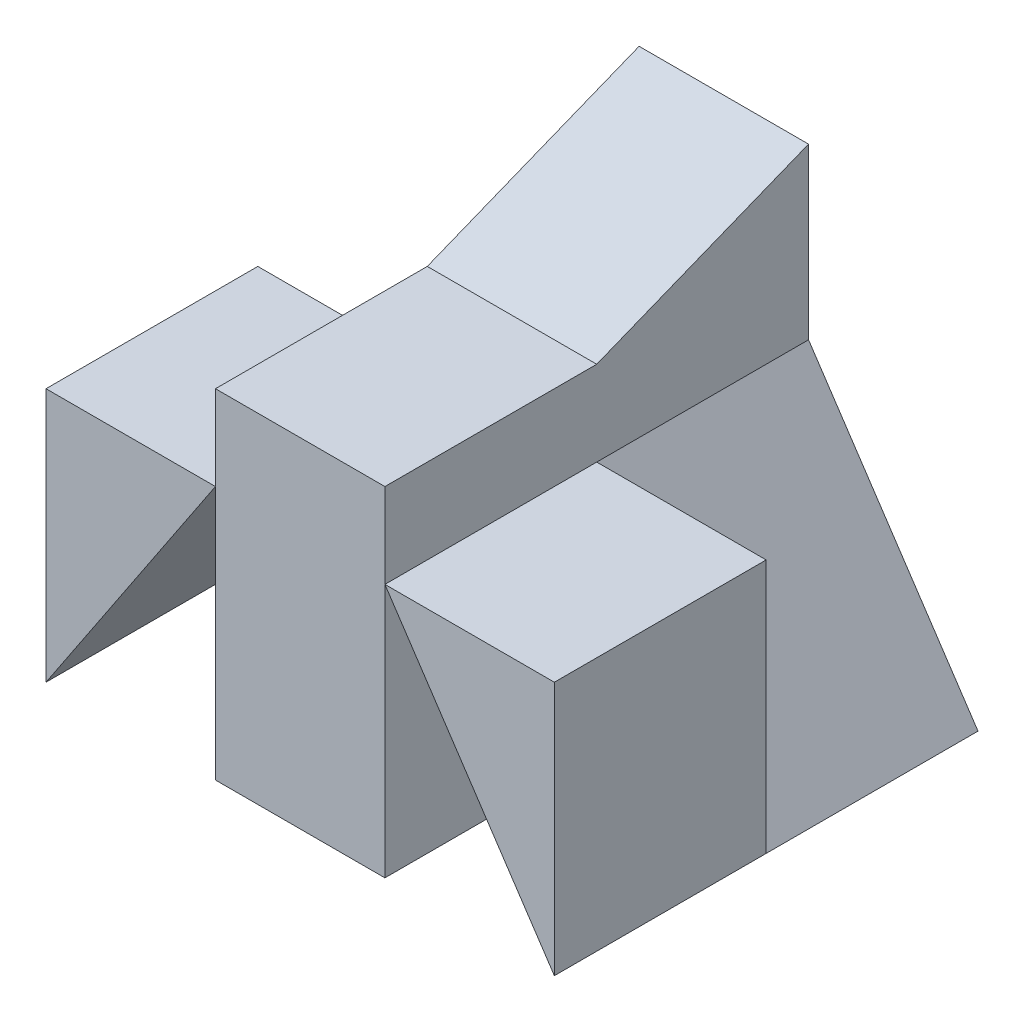
ISO-10303-21;
HEADER;
FILE_DESCRIPTION(('STEP AP214'),'2;1');
FILE_NAME('part.step','',(''),(''),'','','');
FILE_SCHEMA(('AUTOMOTIVE_DESIGN { 1 0 10303 214 1 1 1 1 }'));
ENDSEC;
DATA;
#1=APPLICATION_CONTEXT('core data for automotive mechanical design processes');
#2=APPLICATION_PROTOCOL_DEFINITION('international standard','automotive_design',2000,#1);
#3=PRODUCT_CONTEXT('',#1,'mechanical');
#4=PRODUCT('Part','Part','',(#3));
#5=PRODUCT_RELATED_PRODUCT_CATEGORY('part','',(#4));
#6=PRODUCT_DEFINITION_FORMATION('','',#4);
#7=PRODUCT_DEFINITION_CONTEXT('part definition',#1,'design');
#8=PRODUCT_DEFINITION('design','',#6,#7);
#9=PRODUCT_DEFINITION_SHAPE('','',#8);
#10=(LENGTH_UNIT() NAMED_UNIT(*) SI_UNIT(.MILLI.,.METRE.));
#11=(NAMED_UNIT(*) PLANE_ANGLE_UNIT() SI_UNIT($,.RADIAN.));
#12=(NAMED_UNIT(*) SI_UNIT($,.STERADIAN.) SOLID_ANGLE_UNIT());
#13=UNCERTAINTY_MEASURE_WITH_UNIT(LENGTH_MEASURE(1.E-05),#10,'distance_accuracy_value','');
#14=(GEOMETRIC_REPRESENTATION_CONTEXT(3) GLOBAL_UNCERTAINTY_ASSIGNED_CONTEXT((#13)) GLOBAL_UNIT_ASSIGNED_CONTEXT((#10,
#11,#12)) REPRESENTATION_CONTEXT('',''));
#15=CARTESIAN_POINT('',(0.,0.,0.));
#16=DIRECTION('',(0.,0.,1.));
#17=DIRECTION('',(1.,0.,0.));
#18=AXIS2_PLACEMENT_3D('',#15,#16,#17);
#19=CARTESIAN_POINT('',(0.,0.,5.));
#20=DIRECTION('',(0.,0.,1.));
#21=DIRECTION('',(1.,0.,0.));
#22=AXIS2_PLACEMENT_3D('',#19,#20,#21);
#23=PLANE('',#22);
#24=DIRECTION('',(0.,1.,0.));
#25=VECTOR('',#24,1.);
#26=CARTESIAN_POINT('',(2.,0.,5.));
#27=LINE('',#26,#25);
#28=CARTESIAN_POINT('',(2.,0.,5.));
#29=VERTEX_POINT('',#28);
#30=CARTESIAN_POINT('',(2.,4.,5.));
#31=VERTEX_POINT('',#30);
#32=EDGE_CURVE('E111',#29,#31,#27,.T.);
#33=ORIENTED_EDGE('',*,*,#32,.F.);
#34=DIRECTION('',(1.,0.,0.));
#35=VECTOR('',#34,1.);
#36=CARTESIAN_POINT('',(0.,0.,5.));
#37=LINE('',#36,#35);
#38=CARTESIAN_POINT('',(4.,0.,5.));
#39=VERTEX_POINT('',#38);
#40=EDGE_CURVE('E130',#29,#39,#37,.T.);
#41=ORIENTED_EDGE('',*,*,#40,.T.);
#42=DIRECTION('',(0.,1.,0.));
#43=VECTOR('',#42,1.);
#44=CARTESIAN_POINT('',(4.,0.,5.));
#45=LINE('',#44,#43);
#46=CARTESIAN_POINT('',(4.,4.,5.));
#47=VERTEX_POINT('',#46);
#48=EDGE_CURVE('E139',#39,#47,#45,.T.);
#49=ORIENTED_EDGE('',*,*,#48,.T.);
#50=DIRECTION('',(1.,0.,0.));
#51=VECTOR('',#50,1.);
#52=CARTESIAN_POINT('',(0.,4.,5.));
#53=LINE('',#52,#51);
#54=EDGE_CURVE('E141',#31,#47,#53,.T.);
#55=ORIENTED_EDGE('',*,*,#54,.F.);
#56=EDGE_LOOP('',(#33,#41,#49,#55));
#57=FACE_BOUND('',#56,.T.);
#58=ADVANCED_FACE('F46',(#57),#23,.T.);
#59=CARTESIAN_POINT('',(0.,0.,5.));
#60=DIRECTION('',(0.,1.,0.));
#61=DIRECTION('',(0.,0.,1.));
#62=AXIS2_PLACEMENT_3D('',#59,#60,#61);
#63=PLANE('',#62);
#64=ORIENTED_EDGE('',*,*,#40,.F.);
#65=DIRECTION('',(0.,0.,1.));
#66=VECTOR('',#65,1.);
#67=CARTESIAN_POINT('',(2.,0.,2.5));
#68=LINE('',#67,#66);
#69=CARTESIAN_POINT('',(2.,0.,2.5));
#70=VERTEX_POINT('',#69);
#71=EDGE_CURVE('E120',#70,#29,#68,.T.);
#72=ORIENTED_EDGE('',*,*,#71,.F.);
#73=DIRECTION('',(1.,0.,0.));
#74=VECTOR('',#73,1.);
#75=CARTESIAN_POINT('',(0.,0.,2.5));
#76=LINE('',#75,#74);
#77=CARTESIAN_POINT('',(0.,0.,2.5));
#78=VERTEX_POINT('',#77);
#79=EDGE_CURVE('E12',#78,#70,#76,.T.);
#80=ORIENTED_EDGE('',*,*,#79,.F.);
#81=DIRECTION('',(0.,0.,-1.));
#82=VECTOR('',#81,1.);
#83=CARTESIAN_POINT('',(0.,0.,2.5));
#84=LINE('',#83,#82);
#85=CARTESIAN_POINT('',(0.,0.,0.));
#86=VERTEX_POINT('',#85);
#87=EDGE_CURVE('E137',#78,#86,#84,.T.);
#88=ORIENTED_EDGE('',*,*,#87,.T.);
#89=DIRECTION('',(1.,0.,0.));
#90=VECTOR('',#89,1.);
#91=CARTESIAN_POINT('',(0.,0.,0.));
#92=LINE('',#91,#90);
#93=CARTESIAN_POINT('',(6.,0.,0.));
#94=VERTEX_POINT('',#93);
#95=EDGE_CURVE('E138',#86,#94,#92,.T.);
#96=ORIENTED_EDGE('',*,*,#95,.T.);
#97=DIRECTION('',(0.,0.,-1.));
#98=VECTOR('',#97,1.);
#99=CARTESIAN_POINT('',(6.,0.,2.5));
#100=LINE('',#99,#98);
#101=CARTESIAN_POINT('',(6.,0.,2.5));
#102=VERTEX_POINT('',#101);
#103=EDGE_CURVE('E172',#102,#94,#100,.T.);
#104=ORIENTED_EDGE('',*,*,#103,.F.);
#105=DIRECTION('',(1.,0.,0.));
#106=VECTOR('',#105,1.);
#107=CARTESIAN_POINT('',(6.,0.,2.5));
#108=LINE('',#107,#106);
#109=CARTESIAN_POINT('',(4.,0.,2.5));
#110=VERTEX_POINT('',#109);
#111=EDGE_CURVE('E179',#110,#102,#108,.T.);
#112=ORIENTED_EDGE('',*,*,#111,.F.);
#113=DIRECTION('',(0.,0.,1.));
#114=VECTOR('',#113,1.);
#115=CARTESIAN_POINT('',(4.,0.,2.5));
#116=LINE('',#115,#114);
#117=EDGE_CURVE('E156',#110,#39,#116,.T.);
#118=ORIENTED_EDGE('',*,*,#117,.T.);
#119=EDGE_LOOP('',(#64,#72,#80,#88,#96,#104,#112,#118));
#120=FACE_BOUND('',#119,.T.);
#121=ADVANCED_FACE('F128',(#120),#63,.F.);
#122=CARTESIAN_POINT('',(4.,0.,5.));
#123=DIRECTION('',(-1.,0.,0.));
#124=DIRECTION('',(0.,0.,1.));
#125=AXIS2_PLACEMENT_3D('',#122,#123,#124);
#126=PLANE('',#125);
#127=DIRECTION('',(0.,1.,0.));
#128=VECTOR('',#127,1.);
#129=CARTESIAN_POINT('',(4.,0.,0.));
#130=LINE('',#129,#128);
#131=CARTESIAN_POINT('',(4.,3.,0.));
#132=VERTEX_POINT('',#131);
#133=CARTESIAN_POINT('',(4.,5.,0.));
#134=VERTEX_POINT('',#133);
#135=EDGE_CURVE('E152',#132,#134,#130,.T.);
#136=ORIENTED_EDGE('',*,*,#135,.T.);
#137=DIRECTION('',(0.,0.371390676354103,-0.928476690885259));
#138=VECTOR('',#137,1.);
#139=CARTESIAN_POINT('',(4.,5.,0.));
#140=LINE('',#139,#138);
#141=CARTESIAN_POINT('',(4.,4.,2.5));
#142=VERTEX_POINT('',#141);
#143=EDGE_CURVE('E164',#142,#134,#140,.T.);
#144=ORIENTED_EDGE('',*,*,#143,.F.);
#145=DIRECTION('',(0.,0.,-1.));
#146=VECTOR('',#145,1.);
#147=CARTESIAN_POINT('',(4.,4.,2.5));
#148=LINE('',#147,#146);
#149=EDGE_CURVE('E143',#47,#142,#148,.T.);
#150=ORIENTED_EDGE('',*,*,#149,.F.);
#151=ORIENTED_EDGE('',*,*,#48,.F.);
#152=ORIENTED_EDGE('',*,*,#117,.F.);
#153=DIRECTION('',(0.,-1.,0.));
#154=VECTOR('',#153,1.);
#155=CARTESIAN_POINT('',(4.,0.,2.5));
#156=LINE('',#155,#154);
#157=CARTESIAN_POINT('',(4.,3.,2.5));
#158=VERTEX_POINT('',#157);
#159=EDGE_CURVE('E174',#158,#110,#156,.T.);
#160=ORIENTED_EDGE('',*,*,#159,.F.);
#161=DIRECTION('',(0.,0.,-1.));
#162=VECTOR('',#161,1.);
#163=CARTESIAN_POINT('',(4.,3.,2.5));
#164=LINE('',#163,#162);
#165=EDGE_CURVE('E155',#158,#132,#164,.T.);
#166=ORIENTED_EDGE('',*,*,#165,.T.);
#167=EDGE_LOOP('',(#136,#144,#150,#151,#152,#160,#166));
#168=FACE_BOUND('',#167,.T.);
#169=ADVANCED_FACE('F192',(#168),#126,.F.);
#170=CARTESIAN_POINT('',(2.,0.,5.));
#171=DIRECTION('',(-1.,0.,0.));
#172=DIRECTION('',(0.,0.,1.));
#173=AXIS2_PLACEMENT_3D('',#170,#171,#172);
#174=PLANE('',#173);
#175=DIRECTION('',(0.,-0.371390676354103,0.928476690885259));
#176=VECTOR('',#175,1.);
#177=CARTESIAN_POINT('',(2.,2.58620689655173,6.03448275862069));
#178=LINE('',#177,#176);
#179=CARTESIAN_POINT('',(2.,5.,0.));
#180=VERTEX_POINT('',#179);
#181=CARTESIAN_POINT('',(2.,4.,2.5));
#182=VERTEX_POINT('',#181);
#183=EDGE_CURVE('E151',#180,#182,#178,.T.);
#184=ORIENTED_EDGE('',*,*,#183,.F.);
#185=DIRECTION('',(0.,1.,0.));
#186=VECTOR('',#185,1.);
#187=CARTESIAN_POINT('',(2.,0.,0.));
#188=LINE('',#187,#186);
#189=CARTESIAN_POINT('',(2.,3.,0.));
#190=VERTEX_POINT('',#189);
#191=EDGE_CURVE('E145',#190,#180,#188,.T.);
#192=ORIENTED_EDGE('',*,*,#191,.F.);
#193=DIRECTION('',(0.,0.,-1.));
#194=VECTOR('',#193,1.);
#195=CARTESIAN_POINT('',(2.,3.,2.5));
#196=LINE('',#195,#194);
#197=CARTESIAN_POINT('',(2.,3.,2.5));
#198=VERTEX_POINT('',#197);
#199=EDGE_CURVE('E123',#198,#190,#196,.T.);
#200=ORIENTED_EDGE('',*,*,#199,.F.);
#201=DIRECTION('',(0.,1.,0.));
#202=VECTOR('',#201,1.);
#203=CARTESIAN_POINT('',(2.,0.,2.5));
#204=LINE('',#203,#202);
#205=EDGE_CURVE('E116',#70,#198,#204,.T.);
#206=ORIENTED_EDGE('',*,*,#205,.F.);
#207=ORIENTED_EDGE('',*,*,#71,.T.);
#208=ORIENTED_EDGE('',*,*,#32,.T.);
#209=DIRECTION('',(0.,0.,1.));
#210=VECTOR('',#209,1.);
#211=CARTESIAN_POINT('',(2.,4.,5.));
#212=LINE('',#211,#210);
#213=EDGE_CURVE('E144',#182,#31,#212,.T.);
#214=ORIENTED_EDGE('',*,*,#213,.F.);
#215=EDGE_LOOP('',(#184,#192,#200,#206,#207,#208,#214));
#216=FACE_BOUND('',#215,.T.);
#217=ADVANCED_FACE('F118',(#216),#174,.T.);
#218=CARTESIAN_POINT('',(0.,0.,0.));
#219=DIRECTION('',(0.,0.,1.));
#220=DIRECTION('',(1.,0.,0.));
#221=AXIS2_PLACEMENT_3D('',#218,#219,#220);
#222=PLANE('',#221);
#223=ORIENTED_EDGE('',*,*,#95,.F.);
#224=DIRECTION('',(-0.554700196225229,-0.832050294337844,0.));
#225=VECTOR('',#224,1.);
#226=CARTESIAN_POINT('',(2.,3.,0.));
#227=LINE('',#226,#225);
#228=EDGE_CURVE('E132',#190,#86,#227,.T.);
#229=ORIENTED_EDGE('',*,*,#228,.F.);
#230=ORIENTED_EDGE('',*,*,#191,.T.);
#231=DIRECTION('',(1.,0.,0.));
#232=VECTOR('',#231,1.);
#233=CARTESIAN_POINT('',(0.,5.,0.));
#234=LINE('',#233,#232);
#235=EDGE_CURVE('E148',#180,#134,#234,.T.);
#236=ORIENTED_EDGE('',*,*,#235,.T.);
#237=ORIENTED_EDGE('',*,*,#135,.F.);
#238=DIRECTION('',(-0.554700196225229,0.832050294337844,0.));
#239=VECTOR('',#238,1.);
#240=CARTESIAN_POINT('',(4.,3.,0.));
#241=LINE('',#240,#239);
#242=EDGE_CURVE('E171',#94,#132,#241,.T.);
#243=ORIENTED_EDGE('',*,*,#242,.F.);
#244=EDGE_LOOP('',(#223,#229,#230,#236,#237,#243));
#245=FACE_BOUND('',#244,.T.);
#246=ADVANCED_FACE('F199',(#245),#222,.F.);
#247=CARTESIAN_POINT('',(-1.,5.,0.));
#248=DIRECTION('',(0.,-0.928476690885259,-0.371390676354103));
#249=DIRECTION('',(0.,0.371390676354103,-0.928476690885259));
#250=AXIS2_PLACEMENT_3D('',#247,#248,#249);
#251=PLANE('',#250);
#252=ORIENTED_EDGE('',*,*,#183,.T.);
#253=DIRECTION('',(1.,0.,0.));
#254=VECTOR('',#253,1.);
#255=CARTESIAN_POINT('',(-1.,4.,2.5));
#256=LINE('',#255,#254);
#257=EDGE_CURVE('E166',#182,#142,#256,.T.);
#258=ORIENTED_EDGE('',*,*,#257,.T.);
#259=ORIENTED_EDGE('',*,*,#143,.T.);
#260=ORIENTED_EDGE('',*,*,#235,.F.);
#261=EDGE_LOOP('',(#252,#258,#259,#260));
#262=FACE_BOUND('',#261,.T.);
#263=ADVANCED_FACE('F206',(#262),#251,.F.);
#264=CARTESIAN_POINT('',(-1.,4.,2.5));
#265=DIRECTION('',(0.,-1.,0.));
#266=DIRECTION('',(0.,0.,-1.));
#267=AXIS2_PLACEMENT_3D('',#264,#265,#266);
#268=PLANE('',#267);
#269=ORIENTED_EDGE('',*,*,#213,.T.);
#270=ORIENTED_EDGE('',*,*,#54,.T.);
#271=ORIENTED_EDGE('',*,*,#149,.T.);
#272=ORIENTED_EDGE('',*,*,#257,.F.);
#273=EDGE_LOOP('',(#269,#270,#271,#272));
#274=FACE_BOUND('',#273,.T.);
#275=ADVANCED_FACE('F208',(#274),#268,.F.);
#276=CARTESIAN_POINT('',(4.,3.,2.5));
#277=DIRECTION('',(-0.832050294337844,-0.554700196225229,0.));
#278=DIRECTION('',(0.554700196225229,-0.832050294337844,0.));
#279=AXIS2_PLACEMENT_3D('',#276,#277,#278);
#280=PLANE('',#279);
#281=ORIENTED_EDGE('',*,*,#242,.T.);
#282=ORIENTED_EDGE('',*,*,#165,.F.);
#283=DIRECTION('',(-0.554700196225229,0.832050294337844,0.));
#284=VECTOR('',#283,1.);
#285=CARTESIAN_POINT('',(4.,3.,2.5));
#286=LINE('',#285,#284);
#287=EDGE_CURVE('E136',#102,#158,#286,.T.);
#288=ORIENTED_EDGE('',*,*,#287,.F.);
#289=ORIENTED_EDGE('',*,*,#103,.T.);
#290=EDGE_LOOP('',(#281,#282,#288,#289));
#291=FACE_BOUND('',#290,.T.);
#292=ADVANCED_FACE('F195',(#291),#280,.F.);
#293=CARTESIAN_POINT('',(0.,0.,2.5));
#294=DIRECTION('',(0.,0.,1.));
#295=DIRECTION('',(1.,0.,0.));
#296=AXIS2_PLACEMENT_3D('',#293,#294,#295);
#297=PLANE('',#296);
#298=ORIENTED_EDGE('',*,*,#159,.T.);
#299=ORIENTED_EDGE('',*,*,#111,.T.);
#300=ORIENTED_EDGE('',*,*,#287,.T.);
#301=EDGE_LOOP('',(#298,#299,#300));
#302=FACE_BOUND('',#301,.T.);
#303=ADVANCED_FACE('F186',(#302),#297,.T.);
#304=CARTESIAN_POINT('',(2.,3.,2.5));
#305=DIRECTION('',(0.832050294337844,-0.554700196225229,0.));
#306=DIRECTION('',(0.554700196225229,0.832050294337844,0.));
#307=AXIS2_PLACEMENT_3D('',#304,#305,#306);
#308=PLANE('',#307);
#309=ORIENTED_EDGE('',*,*,#228,.T.);
#310=ORIENTED_EDGE('',*,*,#87,.F.);
#311=DIRECTION('',(-0.554700196225229,-0.832050294337844,0.));
#312=VECTOR('',#311,1.);
#313=CARTESIAN_POINT('',(2.,3.,2.5));
#314=LINE('',#313,#312);
#315=EDGE_CURVE('E49',#198,#78,#314,.T.);
#316=ORIENTED_EDGE('',*,*,#315,.F.);
#317=ORIENTED_EDGE('',*,*,#199,.T.);
#318=EDGE_LOOP('',(#309,#310,#316,#317));
#319=FACE_BOUND('',#318,.T.);
#320=ADVANCED_FACE('F202',(#319),#308,.F.);
#321=CARTESIAN_POINT('',(0.,0.,2.5));
#322=DIRECTION('',(0.,0.,-1.));
#323=DIRECTION('',(-1.,0.,0.));
#324=AXIS2_PLACEMENT_3D('',#321,#322,#323);
#325=PLANE('',#324);
#326=ORIENTED_EDGE('',*,*,#205,.T.);
#327=ORIENTED_EDGE('',*,*,#315,.T.);
#328=ORIENTED_EDGE('',*,*,#79,.T.);
#329=EDGE_LOOP('',(#326,#327,#328));
#330=FACE_BOUND('',#329,.T.);
#331=ADVANCED_FACE('F125',(#330),#325,.F.);
#332=CLOSED_SHELL('',(#58,#121,#169,#217,#246,#263,#275,#292,#303,#320,#331));
#333=MANIFOLD_SOLID_BREP('B2',#332);
#334=CARTESIAN_POINT('',(0.,0.,2.5));
#335=DIRECTION('',(0.,0.,-1.));
#336=DIRECTION('',(-1.,0.,0.));
#337=AXIS2_PLACEMENT_3D('',#334,#335,#336);
#338=PLANE('',#337);
#339=DIRECTION('',(0.,1.,0.));
#340=VECTOR('',#339,1.);
#341=CARTESIAN_POINT('',(0.,0.,2.5));
#342=LINE('',#341,#340);
#343=CARTESIAN_POINT('',(0.,0.,2.5));
#344=VERTEX_POINT('',#343);
#345=CARTESIAN_POINT('',(0.,3.,2.5));
#346=VERTEX_POINT('',#345);
#347=EDGE_CURVE('E363',#344,#346,#342,.T.);
#348=ORIENTED_EDGE('',*,*,#347,.T.);
#349=DIRECTION('',(1.,0.,0.));
#350=VECTOR('',#349,1.);
#351=CARTESIAN_POINT('',(0.,3.,2.5));
#352=LINE('',#351,#350);
#353=CARTESIAN_POINT('',(2.,3.,2.5));
#354=VERTEX_POINT('',#353);
#355=EDGE_CURVE('E361',#346,#354,#352,.T.);
#356=ORIENTED_EDGE('',*,*,#355,.T.);
#357=DIRECTION('',(-0.554700196225229,-0.832050294337844,0.));
#358=VECTOR('',#357,1.);
#359=CARTESIAN_POINT('',(2.,3.,2.5));
#360=LINE('',#359,#358);
#361=EDGE_CURVE('E354',#354,#344,#360,.T.);
#362=ORIENTED_EDGE('',*,*,#361,.T.);
#363=EDGE_LOOP('',(#348,#356,#362));
#364=FACE_BOUND('',#363,.T.);
#365=ADVANCED_FACE('F321',(#364),#338,.T.);
#366=CARTESIAN_POINT('',(0.,3.,5.));
#367=DIRECTION('',(0.,1.,0.));
#368=DIRECTION('',(0.,0.,1.));
#369=AXIS2_PLACEMENT_3D('',#366,#367,#368);
#370=PLANE('',#369);
#371=DIRECTION('',(0.,0.,-1.));
#372=VECTOR('',#371,1.);
#373=CARTESIAN_POINT('',(2.,3.,5.));
#374=LINE('',#373,#372);
#375=CARTESIAN_POINT('',(2.,3.,5.));
#376=VERTEX_POINT('',#375);
#377=EDGE_CURVE('E44',#376,#354,#374,.T.);
#378=ORIENTED_EDGE('',*,*,#377,.T.);
#379=ORIENTED_EDGE('',*,*,#355,.F.);
#380=DIRECTION('',(0.,0.,-1.));
#381=VECTOR('',#380,1.);
#382=CARTESIAN_POINT('',(0.,3.,5.));
#383=LINE('',#382,#381);
#384=CARTESIAN_POINT('',(0.,3.,5.));
#385=VERTEX_POINT('',#384);
#386=EDGE_CURVE('E330',#385,#346,#383,.T.);
#387=ORIENTED_EDGE('',*,*,#386,.F.);
#388=DIRECTION('',(1.,0.,0.));
#389=VECTOR('',#388,1.);
#390=CARTESIAN_POINT('',(0.,3.,5.));
#391=LINE('',#390,#389);
#392=EDGE_CURVE('E325',#385,#376,#391,.T.);
#393=ORIENTED_EDGE('',*,*,#392,.T.);
#394=EDGE_LOOP('',(#378,#379,#387,#393));
#395=FACE_BOUND('',#394,.T.);
#396=ADVANCED_FACE('F323',(#395),#370,.T.);
#397=CARTESIAN_POINT('',(0.,0.,5.));
#398=DIRECTION('',(-1.,0.,0.));
#399=DIRECTION('',(0.,0.,1.));
#400=AXIS2_PLACEMENT_3D('',#397,#398,#399);
#401=PLANE('',#400);
#402=ORIENTED_EDGE('',*,*,#386,.T.);
#403=ORIENTED_EDGE('',*,*,#347,.F.);
#404=DIRECTION('',(0.,0.,-1.));
#405=VECTOR('',#404,1.);
#406=CARTESIAN_POINT('',(0.,0.,5.));
#407=LINE('',#406,#405);
#408=CARTESIAN_POINT('',(0.,0.,5.));
#409=VERTEX_POINT('',#408);
#410=EDGE_CURVE('E358',#409,#344,#407,.T.);
#411=ORIENTED_EDGE('',*,*,#410,.F.);
#412=DIRECTION('',(0.,1.,0.));
#413=VECTOR('',#412,1.);
#414=CARTESIAN_POINT('',(0.,0.,5.));
#415=LINE('',#414,#413);
#416=EDGE_CURVE('E369',#409,#385,#415,.T.);
#417=ORIENTED_EDGE('',*,*,#416,.T.);
#418=EDGE_LOOP('',(#402,#403,#411,#417));
#419=FACE_BOUND('',#418,.T.);
#420=ADVANCED_FACE('F377',(#419),#401,.T.);
#421=CARTESIAN_POINT('',(0.,0.,5.));
#422=DIRECTION('',(0.,0.,1.));
#423=DIRECTION('',(1.,0.,0.));
#424=AXIS2_PLACEMENT_3D('',#421,#422,#423);
#425=PLANE('',#424);
#426=DIRECTION('',(-0.554700196225229,-0.832050294337844,0.));
#427=VECTOR('',#426,1.);
#428=CARTESIAN_POINT('',(2.,3.,5.));
#429=LINE('',#428,#427);
#430=EDGE_CURVE('E370',#376,#409,#429,.T.);
#431=ORIENTED_EDGE('',*,*,#430,.F.);
#432=ORIENTED_EDGE('',*,*,#392,.F.);
#433=ORIENTED_EDGE('',*,*,#416,.F.);
#434=EDGE_LOOP('',(#431,#432,#433));
#435=FACE_BOUND('',#434,.T.);
#436=ADVANCED_FACE('F371',(#435),#425,.T.);
#437=CARTESIAN_POINT('',(2.,3.,2.5));
#438=DIRECTION('',(-0.832050294337844,0.554700196225229,0.));
#439=DIRECTION('',(-0.554700196225229,-0.832050294337844,0.));
#440=AXIS2_PLACEMENT_3D('',#437,#438,#439);
#441=PLANE('',#440);
#442=ORIENTED_EDGE('',*,*,#430,.T.);
#443=ORIENTED_EDGE('',*,*,#410,.T.);
#444=ORIENTED_EDGE('',*,*,#361,.F.);
#445=ORIENTED_EDGE('',*,*,#377,.F.);
#446=EDGE_LOOP('',(#442,#443,#444,#445));
#447=FACE_BOUND('',#446,.T.);
#448=ADVANCED_FACE('F356',(#447),#441,.F.);
#449=CLOSED_SHELL('',(#365,#396,#420,#436,#448));
#450=MANIFOLD_SOLID_BREP('B6',#449);
#451=CARTESIAN_POINT('',(0.,0.,5.));
#452=DIRECTION('',(0.,0.,1.));
#453=DIRECTION('',(1.,0.,0.));
#454=AXIS2_PLACEMENT_3D('',#451,#452,#453);
#455=PLANE('',#454);
#456=DIRECTION('',(-0.554700196225229,0.832050294337844,0.));
#457=VECTOR('',#456,1.);
#458=CARTESIAN_POINT('',(4.,3.,5.));
#459=LINE('',#458,#457);
#460=CARTESIAN_POINT('',(6.,0.,5.));
#461=VERTEX_POINT('',#460);
#462=CARTESIAN_POINT('',(4.,3.,5.));
#463=VERTEX_POINT('',#462);
#464=EDGE_CURVE('E458',#461,#463,#459,.T.);
#465=ORIENTED_EDGE('',*,*,#464,.F.);
#466=DIRECTION('',(0.,1.,0.));
#467=VECTOR('',#466,1.);
#468=CARTESIAN_POINT('',(6.,0.,5.));
#469=LINE('',#468,#467);
#470=CARTESIAN_POINT('',(6.,3.,5.));
#471=VERTEX_POINT('',#470);
#472=EDGE_CURVE('E465',#461,#471,#469,.T.);
#473=ORIENTED_EDGE('',*,*,#472,.T.);
#474=DIRECTION('',(1.,0.,0.));
#475=VECTOR('',#474,1.);
#476=CARTESIAN_POINT('',(0.,3.,5.));
#477=LINE('',#476,#475);
#478=EDGE_CURVE('E468',#463,#471,#477,.T.);
#479=ORIENTED_EDGE('',*,*,#478,.F.);
#480=EDGE_LOOP('',(#465,#473,#479));
#481=FACE_BOUND('',#480,.T.);
#482=ADVANCED_FACE('F425',(#481),#455,.T.);
#483=CARTESIAN_POINT('',(0.,0.,2.5));
#484=DIRECTION('',(0.,0.,-1.));
#485=DIRECTION('',(-1.,0.,0.));
#486=AXIS2_PLACEMENT_3D('',#483,#484,#485);
#487=PLANE('',#486);
#488=DIRECTION('',(1.,0.,0.));
#489=VECTOR('',#488,1.);
#490=CARTESIAN_POINT('',(6.,3.,2.5));
#491=LINE('',#490,#489);
#492=CARTESIAN_POINT('',(4.,3.,2.5));
#493=VERTEX_POINT('',#492);
#494=CARTESIAN_POINT('',(6.,3.,2.5));
#495=VERTEX_POINT('',#494);
#496=EDGE_CURVE('E469',#493,#495,#491,.T.);
#497=ORIENTED_EDGE('',*,*,#496,.T.);
#498=DIRECTION('',(0.,-1.,0.));
#499=VECTOR('',#498,1.);
#500=CARTESIAN_POINT('',(6.,0.,2.5));
#501=LINE('',#500,#499);
#502=CARTESIAN_POINT('',(6.,0.,2.5));
#503=VERTEX_POINT('',#502);
#504=EDGE_CURVE('E472',#495,#503,#501,.T.);
#505=ORIENTED_EDGE('',*,*,#504,.T.);
#506=DIRECTION('',(-0.554700196225229,0.832050294337844,0.));
#507=VECTOR('',#506,1.);
#508=CARTESIAN_POINT('',(4.,3.,2.5));
#509=LINE('',#508,#507);
#510=EDGE_CURVE('E434',#503,#493,#509,.T.);
#511=ORIENTED_EDGE('',*,*,#510,.T.);
#512=EDGE_LOOP('',(#497,#505,#511));
#513=FACE_BOUND('',#512,.T.);
#514=ADVANCED_FACE('F481',(#513),#487,.T.);
#515=CARTESIAN_POINT('',(0.,3.,5.));
#516=DIRECTION('',(0.,1.,0.));
#517=DIRECTION('',(0.,0.,1.));
#518=AXIS2_PLACEMENT_3D('',#515,#516,#517);
#519=PLANE('',#518);
#520=DIRECTION('',(0.,0.,-1.));
#521=VECTOR('',#520,1.);
#522=CARTESIAN_POINT('',(6.,3.,5.));
#523=LINE('',#522,#521);
#524=EDGE_CURVE('E462',#471,#495,#523,.T.);
#525=ORIENTED_EDGE('',*,*,#524,.T.);
#526=ORIENTED_EDGE('',*,*,#496,.F.);
#527=DIRECTION('',(0.,0.,-1.));
#528=VECTOR('',#527,1.);
#529=CARTESIAN_POINT('',(4.,3.,5.));
#530=LINE('',#529,#528);
#531=EDGE_CURVE('E319',#463,#493,#530,.T.);
#532=ORIENTED_EDGE('',*,*,#531,.F.);
#533=ORIENTED_EDGE('',*,*,#478,.T.);
#534=EDGE_LOOP('',(#525,#526,#532,#533));
#535=FACE_BOUND('',#534,.T.);
#536=ADVANCED_FACE('F478',(#535),#519,.T.);
#537=CARTESIAN_POINT('',(6.,0.,5.));
#538=DIRECTION('',(-1.,0.,0.));
#539=DIRECTION('',(0.,0.,1.));
#540=AXIS2_PLACEMENT_3D('',#537,#538,#539);
#541=PLANE('',#540);
#542=ORIENTED_EDGE('',*,*,#504,.F.);
#543=ORIENTED_EDGE('',*,*,#524,.F.);
#544=ORIENTED_EDGE('',*,*,#472,.F.);
#545=DIRECTION('',(0.,0.,-1.));
#546=VECTOR('',#545,1.);
#547=CARTESIAN_POINT('',(6.,0.,5.));
#548=LINE('',#547,#546);
#549=EDGE_CURVE('E429',#461,#503,#548,.T.);
#550=ORIENTED_EDGE('',*,*,#549,.T.);
#551=EDGE_LOOP('',(#542,#543,#544,#550));
#552=FACE_BOUND('',#551,.T.);
#553=ADVANCED_FACE('F427',(#552),#541,.F.);
#554=CARTESIAN_POINT('',(4.,3.,2.5));
#555=DIRECTION('',(0.832050294337844,0.554700196225229,0.));
#556=DIRECTION('',(-0.554700196225229,0.832050294337844,0.));
#557=AXIS2_PLACEMENT_3D('',#554,#555,#556);
#558=PLANE('',#557);
#559=ORIENTED_EDGE('',*,*,#464,.T.);
#560=ORIENTED_EDGE('',*,*,#531,.T.);
#561=ORIENTED_EDGE('',*,*,#510,.F.);
#562=ORIENTED_EDGE('',*,*,#549,.F.);
#563=EDGE_LOOP('',(#559,#560,#561,#562));
#564=FACE_BOUND('',#563,.T.);
#565=ADVANCED_FACE('F457',(#564),#558,.F.);
#566=CLOSED_SHELL('',(#482,#514,#536,#553,#565));
#567=MANIFOLD_SOLID_BREP('B38',#566);
#568=ADVANCED_BREP_SHAPE_REPRESENTATION('',(#18,#333,#450,#567),#14);
#569=SHAPE_DEFINITION_REPRESENTATION(#9,#568);
ENDSEC;
END-ISO-10303-21;
